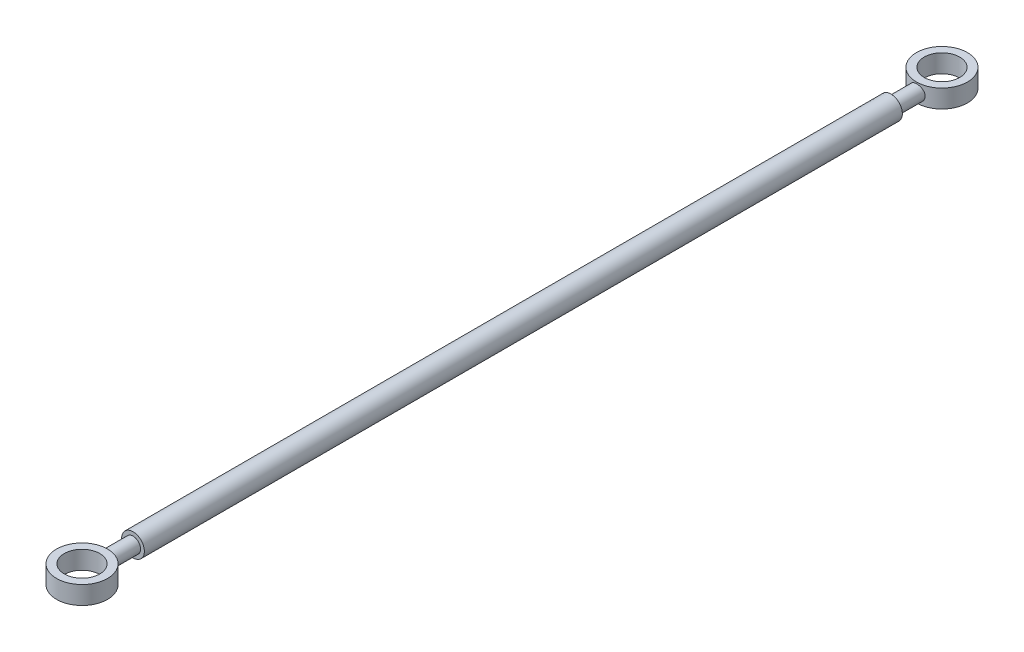
ISO-10303-21;
HEADER;
FILE_DESCRIPTION(('STEP AP214'),'2;1');
FILE_NAME('part.step','',(''),(''),'','','');
FILE_SCHEMA(('AUTOMOTIVE_DESIGN { 1 0 10303 214 1 1 1 1 }'));
ENDSEC;
DATA;
#1=APPLICATION_CONTEXT('core data for automotive mechanical design processes');
#2=APPLICATION_PROTOCOL_DEFINITION('international standard','automotive_design',2000,#1);
#3=PRODUCT_CONTEXT('',#1,'mechanical');
#4=PRODUCT('Part','Part','',(#3));
#5=PRODUCT_RELATED_PRODUCT_CATEGORY('part','',(#4));
#6=PRODUCT_DEFINITION_FORMATION('','',#4);
#7=PRODUCT_DEFINITION_CONTEXT('part definition',#1,'design');
#8=PRODUCT_DEFINITION('design','',#6,#7);
#9=PRODUCT_DEFINITION_SHAPE('','',#8);
#10=(LENGTH_UNIT() NAMED_UNIT(*) SI_UNIT(.MILLI.,.METRE.));
#11=(NAMED_UNIT(*) PLANE_ANGLE_UNIT() SI_UNIT($,.RADIAN.));
#12=(NAMED_UNIT(*) SI_UNIT($,.STERADIAN.) SOLID_ANGLE_UNIT());
#13=UNCERTAINTY_MEASURE_WITH_UNIT(LENGTH_MEASURE(1.E-05),#10,'distance_accuracy_value','');
#14=(GEOMETRIC_REPRESENTATION_CONTEXT(3) GLOBAL_UNCERTAINTY_ASSIGNED_CONTEXT((#13)) GLOBAL_UNIT_ASSIGNED_CONTEXT((#10,
#11,#12)) REPRESENTATION_CONTEXT('',''));
#15=CARTESIAN_POINT('',(0.,0.,0.));
#16=DIRECTION('',(0.,0.,1.));
#17=DIRECTION('',(1.,0.,0.));
#18=AXIS2_PLACEMENT_3D('',#15,#16,#17);
#19=CARTESIAN_POINT('',(0.,0.,5.95000000000001));
#20=DIRECTION('',(0.,0.,1.));
#21=DIRECTION('',(1.,0.,0.));
#22=AXIS2_PLACEMENT_3D('',#19,#20,#21);
#23=CYLINDRICAL_SURFACE('',#22,2.);
#24=CARTESIAN_POINT('',(0.,0.,213.45));
#25=DIRECTION('',(0.,0.,1.));
#26=DIRECTION('',(1.,0.,0.));
#27=AXIS2_PLACEMENT_3D('',#24,#25,#26);
#28=CIRCLE('',#27,2.);
#29=CARTESIAN_POINT('',(2.,0.,213.45));
#30=VERTEX_POINT('',#29);
#31=EDGE_CURVE('E10',#30,#30,#28,.F.);
#32=ORIENTED_EDGE('',*,*,#31,.F.);
#33=EDGE_LOOP('',(#32));
#34=FACE_BOUND('',#33,.T.);
#35=CARTESIAN_POINT('',(2.,0.,220.479281582253));
#36=CARTESIAN_POINT('',(1.99999851560738,0.109640870714026,220.479280366035));
#37=CARTESIAN_POINT('',(1.99095349170802,0.219296457513431,220.476442493243));
#38=CARTESIAN_POINT('',(1.95510353809183,0.435404942564613,220.46544201846));
#39=CARTESIAN_POINT('',(1.92829243842082,0.541856714736717,220.457277566623));
#40=CARTESIAN_POINT('',(1.85789863509272,0.74839798022177,220.43662863254));
#41=CARTESIAN_POINT('',(1.8143434668586,0.8484976063366,220.424151246243));
#42=CARTESIAN_POINT('',(1.71178806605942,1.03999290575109,220.396291888766));
#43=CARTESIAN_POINT('',(1.65278560842055,1.13138732253767,220.380909499229));
#44=CARTESIAN_POINT('',(1.5190460428306,1.30572023299706,220.348436845618));
#45=CARTESIAN_POINT('',(1.44391249598951,1.38834798079452,220.33131067637));
#46=CARTESIAN_POINT('',(1.28089334447942,1.54003606714713,220.297587124875));
#47=CARTESIAN_POINT('',(1.19300613086745,1.60909469129368,220.280989809669));
#48=CARTESIAN_POINT('',(1.00476841709437,1.73302917884108,220.249786772457));
#49=CARTESIAN_POINT('',(0.904201221694222,1.78758884956249,220.235228291808));
#50=CARTESIAN_POINT('',(0.69481291712832,1.87890181413536,220.210160003064));
#51=CARTESIAN_POINT('',(0.58599356142992,1.91565887859552,220.199649337735));
#52=CARTESIAN_POINT('',(0.366440327600565,1.96929673227082,220.184114985807));
#53=CARTESIAN_POINT('',(0.255846520120227,1.98670779177728,220.178945202559));
#54=CARTESIAN_POINT('',(0.0331947451205641,2.00283543386751,220.174160912561));
#55=CARTESIAN_POINT('',(-0.078862915228616,2.00155587741947,220.174545258479));
#56=CARTESIAN_POINT('',(-0.297543781955329,1.98069597961743,220.18072234133));
#57=CARTESIAN_POINT('',(-0.404227300094144,1.96168976313143,220.186345402318));
#58=CARTESIAN_POINT('',(-0.612815719991121,1.90685304982253,220.20216238028));
#59=CARTESIAN_POINT('',(-0.714720320723407,1.87102149472642,220.212356584765));
#60=CARTESIAN_POINT('',(-0.912231161223355,1.78315836788783,220.236406379095));
#61=CARTESIAN_POINT('',(-1.00775132084728,1.7309449285515,220.250302794915));
#62=CARTESIAN_POINT('',(-1.18885875631339,1.61194366841243,220.280281084691));
#63=CARTESIAN_POINT('',(-1.27444370107462,1.54515243779459,220.296363469622));
#64=CARTESIAN_POINT('',(-1.43667782212152,1.39590804115211,220.329710381038));
#65=CARTESIAN_POINT('',(-1.51286524763986,1.31295712424591,220.346996609429));
#66=CARTESIAN_POINT('',(-1.65037709434811,1.13528671287647,220.380268485835));
#67=CARTESIAN_POINT('',(-1.7117000910596,1.04056609182112,220.396254009104));
#68=CARTESIAN_POINT('',(-1.81821284350666,0.84084712084729,220.425216983731));
#69=CARTESIAN_POINT('',(-1.86324759780941,0.735761548860513,220.438165142782));
#70=CARTESIAN_POINT('',(-1.93484578229086,0.519023963553533,220.4592387343));
#71=CARTESIAN_POINT('',(-1.96141511599137,0.407374061287613,220.467365708012));
#72=CARTESIAN_POINT('',(-1.99447071211371,0.185065651450187,220.477539287428));
#73=CARTESIAN_POINT('',(-2.0016578148627,0.0745209720808633,220.479797968749));
#74=CARTESIAN_POINT('',(-1.99769994538114,-0.146197373587287,220.478565161083));
#75=CARTESIAN_POINT('',(-1.9865574864935,-0.25637108867696,220.475074460447));
#76=CARTESIAN_POINT('',(-1.94688045721304,-0.470315540046707,220.462944088212));
#77=CARTESIAN_POINT('',(-1.91879476281874,-0.574177829067012,220.454437431091));
#78=CARTESIAN_POINT('',(-1.84654768916541,-0.775709655385415,220.433370801785));
#79=CARTESIAN_POINT('',(-1.80238385719349,-0.873378245166763,220.420810211208));
#80=CARTESIAN_POINT('',(-1.69789727502947,-1.0626072968666,220.39263776731));
#81=CARTESIAN_POINT('',(-1.63717792174735,-1.15393779062483,220.376953978789));
#82=CARTESIAN_POINT('',(-1.50177654125562,-1.32536954846293,220.34445799054));
#83=CARTESIAN_POINT('',(-1.42709123044719,-1.40546816399984,220.327645526041));
#84=CARTESIAN_POINT('',(-1.26258732798229,-1.55521508114858,220.294033733161));
#85=CARTESIAN_POINT('',(-1.17231107986877,-1.62436711855155,220.277257903056));
#86=CARTESIAN_POINT('',(-0.981037336420591,-1.74655124272971,220.246236886566));
#87=CARTESIAN_POINT('',(-0.880040380408562,-1.79958413988639,220.231991572975));
#88=CARTESIAN_POINT('',(-0.670866929999853,-1.88751327306857,220.2077244725));
#89=CARTESIAN_POINT('',(-0.562751460230838,-1.92254552922692,220.197671121849));
#90=CARTESIAN_POINT('',(-0.341816042583998,-1.97383197269679,220.182781283523));
#91=CARTESIAN_POINT('',(-0.228997424541737,-1.99009143128261,220.177943331426));
#92=CARTESIAN_POINT('',(-0.00644828098169629,-2.0029755013884,220.174116930849));
#93=CARTESIAN_POINT('',(0.103237378208294,-2.00032041702638,220.174913884834));
#94=CARTESIAN_POINT('',(0.320532326668108,-1.97716864485407,220.181763637534));
#95=CARTESIAN_POINT('',(0.428141729855648,-1.95667293876499,220.187816147051));
#96=CARTESIAN_POINT('',(0.637142716306885,-1.89886466785401,220.20443721168));
#97=CARTESIAN_POINT('',(0.738587299967468,-1.8617291029875,220.214958175482));
#98=CARTESIAN_POINT('',(0.933859556384472,-1.77185335986215,220.239427506763));
#99=CARTESIAN_POINT('',(1.02768598670588,-1.71911064274097,220.253376431816));
#100=CARTESIAN_POINT('',(1.20827942056772,-1.59758502717247,220.28378196905));
#101=CARTESIAN_POINT('',(1.29472978502124,-1.5283480530679,220.300303879013));
#102=CARTESIAN_POINT('',(1.45502611913537,-1.37662053024966,220.333780183405));
#103=CARTESIAN_POINT('',(1.52886847405531,-1.29412619374,220.350734700267));
#104=CARTESIAN_POINT('',(1.66401147958099,-1.11534009923823,220.383737288877));
#105=CARTESIAN_POINT('',(1.72488397859197,-1.01871634220365,220.399744551877));
#106=CARTESIAN_POINT('',(1.8294484230846,-0.816146374987869,220.428392775536));
#107=CARTESIAN_POINT('',(1.87314888184387,-0.710204816199572,220.441035403254));
#108=CARTESIAN_POINT('',(1.93804172805924,-0.504286981297851,220.460230457429));
#109=CARTESIAN_POINT('',(1.96121288015267,-0.404979997528448,220.467307944032));
#110=CARTESIAN_POINT('',(1.99219123113458,-0.203785913515372,220.476833627253));
#111=CARTESIAN_POINT('',(2.00000137958214,-0.101899312406011,220.479282712595));
#112=CARTESIAN_POINT('',(2.,0.,220.479281582253));
#113=B_SPLINE_CURVE_WITH_KNOTS('',3,(#35,#36,#37,#38,#39,#40,#41,#42,#43,#44,#45,#46,#47,#48,
#49,#50,#51,#52,#53,#54,#55,#56,#57,#58,#59,#60,#61,#62,#63,#64,#65,#66,#67,#68,#69,#70,#71,#72,
#73,#74,#75,#76,#77,#78,#79,#80,#81,#82,#83,#84,#85,#86,#87,#88,#89,#90,#91,#92,#93,#94,#95,#96,
#97,#98,#99,#100,#101,#102,#103,#104,#105,#106,#107,#108,#109,#110,#111,#112),.UNSPECIFIED.,.T.,
.F.,(4,2,2,2,2,2,2,2,2,2,2,2,2,2,2,2,2,2,2,2,2,2,2,2,2,2,2,2,2,2,2,2,2,2,2,2,2,2,4),(0.,
0.328546821910681,0.657207804203182,0.985330603552502,1.31350069272135,1.65091573328383,
1.98837337761497,2.33267792085341,2.67690950814201,3.01145329080327,3.34592796687985,
3.66993255325425,3.99395752146592,4.32171522827139,4.64954968148883,4.98981225024137,
5.33010741393815,5.67356059395358,6.01690391905364,6.34765454228637,6.67835981689266,
7.00066650900189,7.32302238947337,7.65390684119928,7.98486918668786,8.32807607980909,
8.6712657155248,9.01182245656161,9.35228354830027,9.67985043963615,10.0073993069907,
10.3315437973062,10.6557410461942,10.9901796802721,11.3247140381321,11.6689964067162,
12.0131078765363,12.3185152062754,12.6238638871811),.UNSPECIFIED.);
#114=CARTESIAN_POINT('',(2.,0.,220.479281582253));
#115=VERTEX_POINT('',#114);
#116=EDGE_CURVE('E39',#115,#115,#113,.T.);
#117=ORIENTED_EDGE('',*,*,#116,.F.);
#118=EDGE_LOOP('',(#117));
#119=FACE_BOUND('',#118,.T.);
#120=ADVANCED_FACE('F31',(#34,#119),#23,.T.);
#121=CARTESIAN_POINT('',(0.,2.4,226.9));
#122=DIRECTION('',(0.,-1.,0.));
#123=DIRECTION('',(0.,0.,-1.));
#124=AXIS2_PLACEMENT_3D('',#121,#122,#123);
#125=CYLINDRICAL_SURFACE('',#124,6.725);
#126=ORIENTED_EDGE('',*,*,#116,.T.);
#127=EDGE_LOOP('',(#126));
#128=FACE_BOUND('',#127,.T.);
#129=CARTESIAN_POINT('',(0.,2.4,226.9));
#130=DIRECTION('',(0.,-1.,0.));
#131=DIRECTION('',(0.,0.,-1.));
#132=AXIS2_PLACEMENT_3D('',#129,#130,#131);
#133=CIRCLE('',#132,6.725);
#134=CARTESIAN_POINT('',(0.,2.4,220.175));
#135=VERTEX_POINT('',#134);
#136=EDGE_CURVE('E125',#135,#135,#133,.T.);
#137=ORIENTED_EDGE('',*,*,#136,.T.);
#138=EDGE_LOOP('',(#137));
#139=FACE_BOUND('',#138,.T.);
#140=CARTESIAN_POINT('',(0.,-2.4,226.9));
#141=DIRECTION('',(0.,-1.,0.));
#142=DIRECTION('',(0.,0.,-1.));
#143=AXIS2_PLACEMENT_3D('',#140,#141,#142);
#144=CIRCLE('',#143,6.725);
#145=CARTESIAN_POINT('',(0.,-2.4,220.175));
#146=VERTEX_POINT('',#145);
#147=EDGE_CURVE('E123',#146,#146,#144,.T.);
#148=ORIENTED_EDGE('',*,*,#147,.F.);
#149=EDGE_LOOP('',(#148));
#150=FACE_BOUND('',#149,.T.);
#151=ADVANCED_FACE('F62',(#128,#139,#150),#125,.T.);
#152=CARTESIAN_POINT('',(0.,2.4,226.9));
#153=DIRECTION('',(0.,1.,0.));
#154=DIRECTION('',(0.,0.,-1.));
#155=AXIS2_PLACEMENT_3D('',#152,#153,#154);
#156=PLANE('',#155);
#157=CARTESIAN_POINT('',(0.,2.4,226.9));
#158=DIRECTION('',(0.,-1.,0.));
#159=DIRECTION('',(0.,0.,-1.));
#160=AXIS2_PLACEMENT_3D('',#157,#158,#159);
#161=CIRCLE('',#160,4.68);
#162=CARTESIAN_POINT('',(0.,2.4,222.22));
#163=VERTEX_POINT('',#162);
#164=EDGE_CURVE('E113',#163,#163,#161,.T.);
#165=ORIENTED_EDGE('',*,*,#164,.T.);
#166=EDGE_LOOP('',(#165));
#167=FACE_BOUND('',#166,.T.);
#168=ORIENTED_EDGE('',*,*,#136,.F.);
#169=EDGE_LOOP('',(#168));
#170=FACE_BOUND('',#169,.T.);
#171=ADVANCED_FACE('F66',(#167,#170),#156,.T.);
#172=CARTESIAN_POINT('',(0.,-2.4,226.9));
#173=DIRECTION('',(0.,1.,0.));
#174=DIRECTION('',(0.,0.,-1.));
#175=AXIS2_PLACEMENT_3D('',#172,#173,#174);
#176=PLANE('',#175);
#177=CARTESIAN_POINT('',(0.,-2.4,226.9));
#178=DIRECTION('',(0.,-1.,0.));
#179=DIRECTION('',(0.,0.,-1.));
#180=AXIS2_PLACEMENT_3D('',#177,#178,#179);
#181=CIRCLE('',#180,4.68);
#182=CARTESIAN_POINT('',(0.,-2.4,222.22));
#183=VERTEX_POINT('',#182);
#184=EDGE_CURVE('E110',#183,#183,#181,.T.);
#185=ORIENTED_EDGE('',*,*,#184,.F.);
#186=EDGE_LOOP('',(#185));
#187=FACE_BOUND('',#186,.T.);
#188=ORIENTED_EDGE('',*,*,#147,.T.);
#189=EDGE_LOOP('',(#188));
#190=FACE_BOUND('',#189,.T.);
#191=ADVANCED_FACE('F67',(#187,#190),#176,.F.);
#192=CARTESIAN_POINT('',(0.,2.4,226.9));
#193=DIRECTION('',(0.,-1.,0.));
#194=DIRECTION('',(0.,0.,-1.));
#195=AXIS2_PLACEMENT_3D('',#192,#193,#194);
#196=CYLINDRICAL_SURFACE('',#195,4.68);
#197=ORIENTED_EDGE('',*,*,#164,.F.);
#198=EDGE_LOOP('',(#197));
#199=FACE_BOUND('',#198,.T.);
#200=ORIENTED_EDGE('',*,*,#184,.T.);
#201=EDGE_LOOP('',(#200));
#202=FACE_BOUND('',#201,.T.);
#203=ADVANCED_FACE('F70',(#199,#202),#196,.F.);
#204=CARTESIAN_POINT('',(0.,0.,213.45));
#205=DIRECTION('',(0.,0.,-1.));
#206=DIRECTION('',(-1.,0.,0.));
#207=AXIS2_PLACEMENT_3D('',#204,#205,#206);
#208=CYLINDRICAL_SURFACE('',#207,3.);
#209=CARTESIAN_POINT('',(0.,0.,213.45));
#210=DIRECTION('',(0.,0.,1.));
#211=DIRECTION('',(1.,0.,0.));
#212=AXIS2_PLACEMENT_3D('',#209,#210,#211);
#213=CIRCLE('',#212,3.);
#214=CARTESIAN_POINT('',(3.,0.,213.45));
#215=VERTEX_POINT('',#214);
#216=EDGE_CURVE('E111',#215,#215,#213,.T.);
#217=ORIENTED_EDGE('',*,*,#216,.F.);
#218=EDGE_LOOP('',(#217));
#219=FACE_BOUND('',#218,.T.);
#220=CARTESIAN_POINT('',(0.,0.,13.45));
#221=DIRECTION('',(0.,0.,1.));
#222=DIRECTION('',(1.,0.,0.));
#223=AXIS2_PLACEMENT_3D('',#220,#221,#222);
#224=CIRCLE('',#223,3.);
#225=CARTESIAN_POINT('',(3.,0.,13.45));
#226=VERTEX_POINT('',#225);
#227=EDGE_CURVE('E116',#226,#226,#224,.T.);
#228=ORIENTED_EDGE('',*,*,#227,.T.);
#229=EDGE_LOOP('',(#228));
#230=FACE_BOUND('',#229,.T.);
#231=ADVANCED_FACE('F77',(#219,#230),#208,.T.);
#232=CARTESIAN_POINT('',(0.,0.,213.45));
#233=DIRECTION('',(0.,0.,1.));
#234=DIRECTION('',(1.,0.,0.));
#235=AXIS2_PLACEMENT_3D('',#232,#233,#234);
#236=PLANE('',#235);
#237=ORIENTED_EDGE('',*,*,#31,.T.);
#238=EDGE_LOOP('',(#237));
#239=FACE_BOUND('',#238,.T.);
#240=ORIENTED_EDGE('',*,*,#216,.T.);
#241=EDGE_LOOP('',(#240));
#242=FACE_BOUND('',#241,.T.);
#243=ADVANCED_FACE('F81',(#239,#242),#236,.T.);
#244=CARTESIAN_POINT('',(0.,0.,13.45));
#245=DIRECTION('',(0.,0.,1.));
#246=DIRECTION('',(1.,0.,0.));
#247=AXIS2_PLACEMENT_3D('',#244,#245,#246);
#248=PLANE('',#247);
#249=CARTESIAN_POINT('',(0.,0.,13.45));
#250=DIRECTION('',(0.,0.,1.));
#251=DIRECTION('',(1.,0.,0.));
#252=AXIS2_PLACEMENT_3D('',#249,#250,#251);
#253=CIRCLE('',#252,2.);
#254=CARTESIAN_POINT('',(2.,0.,13.45));
#255=VERTEX_POINT('',#254);
#256=EDGE_CURVE('E59',#255,#255,#253,.F.);
#257=ORIENTED_EDGE('',*,*,#256,.F.);
#258=EDGE_LOOP('',(#257));
#259=FACE_BOUND('',#258,.T.);
#260=ORIENTED_EDGE('',*,*,#227,.F.);
#261=EDGE_LOOP('',(#260));
#262=FACE_BOUND('',#261,.T.);
#263=ADVANCED_FACE('F83',(#259,#262),#248,.F.);
#264=CARTESIAN_POINT('',(0.,2.4,0.));
#265=DIRECTION('',(0.,-1.,0.));
#266=DIRECTION('',(0.,0.,-1.));
#267=AXIS2_PLACEMENT_3D('',#264,#265,#266);
#268=CYLINDRICAL_SURFACE('',#267,4.68);
#269=CARTESIAN_POINT('',(0.,2.4,0.));
#270=DIRECTION('',(0.,1.,0.));
#271=DIRECTION('',(0.,0.,1.));
#272=AXIS2_PLACEMENT_3D('',#269,#270,#271);
#273=CIRCLE('',#272,4.68);
#274=CARTESIAN_POINT('',(0.,2.4,4.68));
#275=VERTEX_POINT('',#274);
#276=EDGE_CURVE('E130',#275,#275,#273,.T.);
#277=ORIENTED_EDGE('',*,*,#276,.T.);
#278=EDGE_LOOP('',(#277));
#279=FACE_BOUND('',#278,.T.);
#280=CARTESIAN_POINT('',(0.,-2.4,0.));
#281=DIRECTION('',(0.,1.,0.));
#282=DIRECTION('',(0.,0.,1.));
#283=AXIS2_PLACEMENT_3D('',#280,#281,#282);
#284=CIRCLE('',#283,4.68);
#285=CARTESIAN_POINT('',(0.,-2.4,4.68));
#286=VERTEX_POINT('',#285);
#287=EDGE_CURVE('E133',#286,#286,#284,.T.);
#288=ORIENTED_EDGE('',*,*,#287,.F.);
#289=EDGE_LOOP('',(#288));
#290=FACE_BOUND('',#289,.T.);
#291=ADVANCED_FACE('F86',(#279,#290),#268,.F.);
#292=CARTESIAN_POINT('',(0.,-2.4,0.));
#293=DIRECTION('',(0.,1.,0.));
#294=DIRECTION('',(0.,0.,1.));
#295=AXIS2_PLACEMENT_3D('',#292,#293,#294);
#296=PLANE('',#295);
#297=CARTESIAN_POINT('',(0.,-2.4,0.));
#298=DIRECTION('',(0.,1.,0.));
#299=DIRECTION('',(0.,0.,1.));
#300=AXIS2_PLACEMENT_3D('',#297,#298,#299);
#301=CIRCLE('',#300,6.725);
#302=CARTESIAN_POINT('',(0.,-2.4,6.725));
#303=VERTEX_POINT('',#302);
#304=EDGE_CURVE('E48',#303,#303,#301,.T.);
#305=ORIENTED_EDGE('',*,*,#304,.F.);
#306=EDGE_LOOP('',(#305));
#307=FACE_BOUND('',#306,.T.);
#308=ORIENTED_EDGE('',*,*,#287,.T.);
#309=EDGE_LOOP('',(#308));
#310=FACE_BOUND('',#309,.T.);
#311=ADVANCED_FACE('F139',(#307,#310),#296,.F.);
#312=CARTESIAN_POINT('',(0.,2.4,0.));
#313=DIRECTION('',(0.,1.,0.));
#314=DIRECTION('',(0.,0.,1.));
#315=AXIS2_PLACEMENT_3D('',#312,#313,#314);
#316=PLANE('',#315);
#317=CARTESIAN_POINT('',(0.,2.4,0.));
#318=DIRECTION('',(0.,1.,0.));
#319=DIRECTION('',(0.,0.,1.));
#320=AXIS2_PLACEMENT_3D('',#317,#318,#319);
#321=CIRCLE('',#320,6.725);
#322=CARTESIAN_POINT('',(0.,2.4,6.725));
#323=VERTEX_POINT('',#322);
#324=EDGE_CURVE('E43',#323,#323,#321,.T.);
#325=ORIENTED_EDGE('',*,*,#324,.T.);
#326=EDGE_LOOP('',(#325));
#327=FACE_BOUND('',#326,.T.);
#328=ORIENTED_EDGE('',*,*,#276,.F.);
#329=EDGE_LOOP('',(#328));
#330=FACE_BOUND('',#329,.T.);
#331=ADVANCED_FACE('F103',(#327,#330),#316,.T.);
#332=CARTESIAN_POINT('',(0.,2.4,0.));
#333=DIRECTION('',(0.,-1.,0.));
#334=DIRECTION('',(0.,0.,-1.));
#335=AXIS2_PLACEMENT_3D('',#332,#333,#334);
#336=CYLINDRICAL_SURFACE('',#335,6.725);
#337=CARTESIAN_POINT('',(2.,0.,6.42071841774735));
#338=CARTESIAN_POINT('',(1.99999851560738,-0.109640870714025,6.42071963396486));
#339=CARTESIAN_POINT('',(1.99095349170802,-0.21929645751343,6.4235575067565));
#340=CARTESIAN_POINT('',(1.95510353809183,-0.435404942564612,6.4345579815401));
#341=CARTESIAN_POINT('',(1.92829243842082,-0.541856714736716,6.4427224333766));
#342=CARTESIAN_POINT('',(1.85789863509272,-0.74839798022177,6.46337136745985));
#343=CARTESIAN_POINT('',(1.8143434668586,-0.848497606336604,6.47584875375686));
#344=CARTESIAN_POINT('',(1.71178806605942,-1.03999290575109,6.50370811123425));
#345=CARTESIAN_POINT('',(1.65278560842054,-1.13138732253767,6.51909050077097));
#346=CARTESIAN_POINT('',(1.5190460428306,-1.30572023299707,6.55156315438238));
#347=CARTESIAN_POINT('',(1.44391249598951,-1.38834798079452,6.5686893236298));
#348=CARTESIAN_POINT('',(1.28089334447941,-1.54003606714713,6.60241287512453));
#349=CARTESIAN_POINT('',(1.19300613086745,-1.60909469129369,6.61901019033142));
#350=CARTESIAN_POINT('',(1.00476841709437,-1.73302917884108,6.65021322754287));
#351=CARTESIAN_POINT('',(0.904201221694223,-1.78758884956249,6.6647717081922));
#352=CARTESIAN_POINT('',(0.694812917128323,-1.87890181413536,6.68983999693603));
#353=CARTESIAN_POINT('',(0.585993561429921,-1.91565887859551,6.70035066226491));
#354=CARTESIAN_POINT('',(0.366440327600566,-1.96929673227082,6.71588501419302));
#355=CARTESIAN_POINT('',(0.255846520120227,-1.98670779177728,6.72105479744062));
#356=CARTESIAN_POINT('',(0.033194745120564,-2.00283543386751,6.72583908743936));
#357=CARTESIAN_POINT('',(-0.0788629152286166,-2.00155587741947,6.7254547415213));
#358=CARTESIAN_POINT('',(-0.29754378195533,-1.98069597961743,6.71927765866968));
#359=CARTESIAN_POINT('',(-0.404227300094145,-1.96168976313143,6.71365459768178));
#360=CARTESIAN_POINT('',(-0.612815719991122,-1.90685304982253,6.69783761972046));
#361=CARTESIAN_POINT('',(-0.714720320723408,-1.87102149472642,6.68764341523496));
#362=CARTESIAN_POINT('',(-0.912231161223356,-1.78315836788783,6.66359362090468));
#363=CARTESIAN_POINT('',(-1.00775132084728,-1.7309449285515,6.6496972050846));
#364=CARTESIAN_POINT('',(-1.18885875631339,-1.61194366841243,6.61971891530944));
#365=CARTESIAN_POINT('',(-1.27444370107462,-1.54515243779459,6.60363653037829));
#366=CARTESIAN_POINT('',(-1.43667782212152,-1.39590804115211,6.57028961896218));
#367=CARTESIAN_POINT('',(-1.51286524763986,-1.31295712424591,6.55300339057145));
#368=CARTESIAN_POINT('',(-1.65037709434811,-1.13528671287647,6.51973151416523));
#369=CARTESIAN_POINT('',(-1.7117000910596,-1.04056609182112,6.50374599089551));
#370=CARTESIAN_POINT('',(-1.81821284350666,-0.840847120847291,6.47478301626949));
#371=CARTESIAN_POINT('',(-1.86324759780941,-0.735761548860516,6.46183485721795));
#372=CARTESIAN_POINT('',(-1.93484578229086,-0.519023963553537,6.44076126569951));
#373=CARTESIAN_POINT('',(-1.96141511599137,-0.407374061287614,6.4326342919883));
#374=CARTESIAN_POINT('',(-1.99447071211371,-0.185065651450186,6.42246071257172));
#375=CARTESIAN_POINT('',(-2.0016578148627,-0.0745209720808615,6.4202020312505));
#376=CARTESIAN_POINT('',(-1.99769994538114,0.146197373587289,6.42143483891747));
#377=CARTESIAN_POINT('',(-1.9865574864935,0.256371088676962,6.42492553955255));
#378=CARTESIAN_POINT('',(-1.94688045721304,0.47031554004671,6.4370559117876));
#379=CARTESIAN_POINT('',(-1.91879476281874,0.574177829067015,6.44556256890921));
#380=CARTESIAN_POINT('',(-1.8465476891654,0.775709655385419,6.46662919821491));
#381=CARTESIAN_POINT('',(-1.80238385719348,0.873378245166766,6.4791897887916));
#382=CARTESIAN_POINT('',(-1.69789727502947,1.0626072968666,6.50736223269043));
#383=CARTESIAN_POINT('',(-1.63717792174735,1.15393779062483,6.52304602121144));
#384=CARTESIAN_POINT('',(-1.50177654125562,1.32536954846293,6.55554200946026));
#385=CARTESIAN_POINT('',(-1.42709123044719,1.40546816399984,6.57235447395906));
#386=CARTESIAN_POINT('',(-1.26258732798228,1.55521508114858,6.60596626683931));
#387=CARTESIAN_POINT('',(-1.17231107986877,1.62436711855156,6.62274209694385));
#388=CARTESIAN_POINT('',(-0.981037336420583,1.74655124272971,6.65376311343411));
#389=CARTESIAN_POINT('',(-0.880040380408555,1.7995841398864,6.66800842702529));
#390=CARTESIAN_POINT('',(-0.670866929999849,1.88751327306858,6.69227552749999));
#391=CARTESIAN_POINT('',(-0.562751460230836,1.92254552922692,6.70232887815126));
#392=CARTESIAN_POINT('',(-0.341816042583996,1.97383197269679,6.71721871647686));
#393=CARTESIAN_POINT('',(-0.228997424541735,1.99009143128261,6.72205666857442));
#394=CARTESIAN_POINT('',(-0.00644828098169397,2.0029755013884,6.72588306915083));
#395=CARTESIAN_POINT('',(0.103237378208296,2.00032041702638,6.72508611516625));
#396=CARTESIAN_POINT('',(0.32053232666811,1.97716864485407,6.71823636246605));
#397=CARTESIAN_POINT('',(0.428141729855651,1.95667293876499,6.71218385294951));
#398=CARTESIAN_POINT('',(0.637142716306889,1.89886466785401,6.69556278831966));
#399=CARTESIAN_POINT('',(0.738587299967471,1.8617291029875,6.68504182451771));
#400=CARTESIAN_POINT('',(0.933859556384475,1.77185335986215,6.6605724932367));
#401=CARTESIAN_POINT('',(1.02768598670589,1.71911064274097,6.64662356818352));
#402=CARTESIAN_POINT('',(1.20827942056772,1.59758502717247,6.6162180309499));
#403=CARTESIAN_POINT('',(1.29472978502124,1.5283480530679,6.59969612098697));
#404=CARTESIAN_POINT('',(1.45502611913537,1.37662053024966,6.56621981659491));
#405=CARTESIAN_POINT('',(1.52886847405531,1.29412619374,6.54926529973261));
#406=CARTESIAN_POINT('',(1.66401147958099,1.11534009923823,6.51626271112317));
#407=CARTESIAN_POINT('',(1.72488397859197,1.01871634220365,6.5002554481235));
#408=CARTESIAN_POINT('',(1.8294484230846,0.816146374987871,6.47160722446416));
#409=CARTESIAN_POINT('',(1.87314888184387,0.710204816199572,6.45896459674564));
#410=CARTESIAN_POINT('',(1.93804172805924,0.504286981297851,6.4397695425711));
#411=CARTESIAN_POINT('',(1.96121288015267,0.404979997528449,6.43269205596782));
#412=CARTESIAN_POINT('',(1.99219123113458,0.203785913515373,6.4231663727466));
#413=CARTESIAN_POINT('',(2.00000137958214,0.101899312406011,6.42071728740491));
#414=CARTESIAN_POINT('',(2.,0.,6.42071841774735));
#415=B_SPLINE_CURVE_WITH_KNOTS('',3,(#337,#338,#339,#340,#341,#342,#343,#344,#345,#346,#347,
#348,#349,#350,#351,#352,#353,#354,#355,#356,#357,#358,#359,#360,#361,#362,#363,#364,#365,#366,
#367,#368,#369,#370,#371,#372,#373,#374,#375,#376,#377,#378,#379,#380,#381,#382,#383,#384,#385,
#386,#387,#388,#389,#390,#391,#392,#393,#394,#395,#396,#397,#398,#399,#400,#401,#402,#403,#404,
#405,#406,#407,#408,#409,#410,#411,#412,#413,#414),.UNSPECIFIED.,.T.,.F.,(4,2,2,2,2,2,2,2,2,2,2,
2,2,2,2,2,2,2,2,2,2,2,2,2,2,2,2,2,2,2,2,2,2,2,2,2,2,2,4),(0.,0.328546821910679,
0.657207804203183,0.985330603552508,1.31350069272135,1.65091573328383,1.98837337761497,
2.33267792085341,2.67690950814201,3.01145329080327,3.34592796687985,3.66993255325425,
3.99395752146592,4.32171522827139,4.64954968148883,4.98981225024136,5.33010741393815,
5.67356059395358,6.01690391905364,6.34765454228637,6.67835981689267,7.0006665090019,
7.32302238947338,7.65390684119928,7.98486918668786,8.3280760798091,8.6712657155248,
9.01182245656161,9.35228354830027,9.67985043963615,10.0073993069907,10.3315437973062,
10.6557410461942,10.9901796802721,11.3247140381321,11.6689964067162,12.0131078765363,
12.3185152062754,12.6238638871811),.UNSPECIFIED.);
#416=CARTESIAN_POINT('',(2.,0.,6.42071841774735));
#417=VERTEX_POINT('',#416);
#418=EDGE_CURVE('E55',#417,#417,#415,.T.);
#419=ORIENTED_EDGE('',*,*,#418,.T.);
#420=EDGE_LOOP('',(#419));
#421=FACE_BOUND('',#420,.T.);
#422=ORIENTED_EDGE('',*,*,#324,.F.);
#423=EDGE_LOOP('',(#422));
#424=FACE_BOUND('',#423,.T.);
#425=ORIENTED_EDGE('',*,*,#304,.T.);
#426=EDGE_LOOP('',(#425));
#427=FACE_BOUND('',#426,.T.);
#428=ADVANCED_FACE('F33',(#421,#424,#427),#336,.T.);
#429=ORIENTED_EDGE('',*,*,#418,.F.);
#430=EDGE_LOOP('',(#429));
#431=FACE_BOUND('',#430,.T.);
#432=ORIENTED_EDGE('',*,*,#256,.T.);
#433=EDGE_LOOP('',(#432));
#434=FACE_BOUND('',#433,.T.);
#435=ADVANCED_FACE('F94',(#431,#434),#23,.T.);
#436=CLOSED_SHELL('',(#120,#151,#171,#191,#203,#231,#243,#263,#291,#311,#331,#428,#435));
#437=MANIFOLD_SOLID_BREP('B2',#436);
#438=ADVANCED_BREP_SHAPE_REPRESENTATION('',(#18,#437),#14);
#439=SHAPE_DEFINITION_REPRESENTATION(#9,#438);
ENDSEC;
END-ISO-10303-21;
